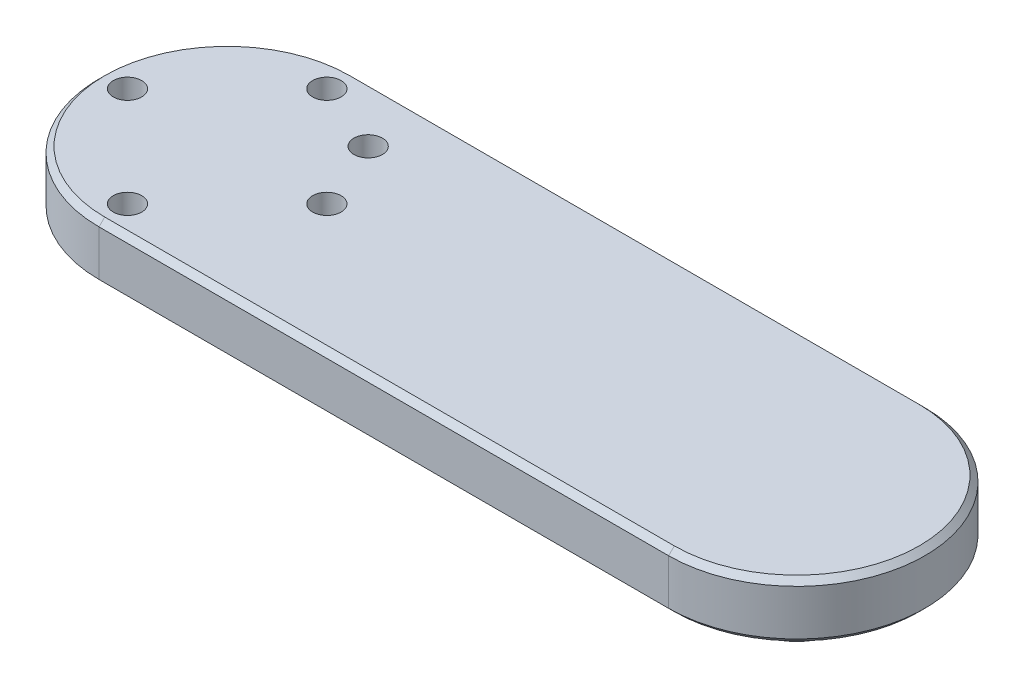
ISO-10303-21;
HEADER;
FILE_DESCRIPTION(('STEP AP214'),'2;1');
FILE_NAME('part.step','',(''),(''),'','','');
FILE_SCHEMA(('AUTOMOTIVE_DESIGN { 1 0 10303 214 1 1 1 1 }'));
ENDSEC;
DATA;
#1=APPLICATION_CONTEXT('core data for automotive mechanical design processes');
#2=APPLICATION_PROTOCOL_DEFINITION('international standard','automotive_design',2000,#1);
#3=PRODUCT_CONTEXT('',#1,'mechanical');
#4=PRODUCT('Part','Part','',(#3));
#5=PRODUCT_RELATED_PRODUCT_CATEGORY('part','',(#4));
#6=PRODUCT_DEFINITION_FORMATION('','',#4);
#7=PRODUCT_DEFINITION_CONTEXT('part definition',#1,'design');
#8=PRODUCT_DEFINITION('design','',#6,#7);
#9=PRODUCT_DEFINITION_SHAPE('','',#8);
#10=(LENGTH_UNIT() NAMED_UNIT(*) SI_UNIT(.MILLI.,.METRE.));
#11=(NAMED_UNIT(*) PLANE_ANGLE_UNIT() SI_UNIT($,.RADIAN.));
#12=(NAMED_UNIT(*) SI_UNIT($,.STERADIAN.) SOLID_ANGLE_UNIT());
#13=UNCERTAINTY_MEASURE_WITH_UNIT(LENGTH_MEASURE(1.E-05),#10,'distance_accuracy_value','');
#14=(GEOMETRIC_REPRESENTATION_CONTEXT(3) GLOBAL_UNCERTAINTY_ASSIGNED_CONTEXT((#13)) GLOBAL_UNIT_ASSIGNED_CONTEXT((#10,
#11,#12)) REPRESENTATION_CONTEXT('',''));
#15=CARTESIAN_POINT('',(0.,0.,0.));
#16=DIRECTION('',(0.,0.,1.));
#17=DIRECTION('',(1.,0.,0.));
#18=AXIS2_PLACEMENT_3D('',#15,#16,#17);
#19=CARTESIAN_POINT('',(-100.,20.,0.));
#20=DIRECTION('',(0.,-1.,0.));
#21=DIRECTION('',(0.,0.,-1.));
#22=AXIS2_PLACEMENT_3D('',#19,#20,#21);
#23=CYLINDRICAL_SURFACE('',#22,45.);
#24=DIRECTION('',(0.,-1.,0.));
#25=VECTOR('',#24,1.);
#26=CARTESIAN_POINT('',(-100.,20.,45.));
#27=LINE('',#26,#25);
#28=CARTESIAN_POINT('',(-100.,18.,45.));
#29=VERTEX_POINT('',#28);
#30=CARTESIAN_POINT('',(-100.,2.,45.));
#31=VERTEX_POINT('',#30);
#32=EDGE_CURVE('E177',#29,#31,#27,.T.);
#33=ORIENTED_EDGE('',*,*,#32,.F.);
#34=CARTESIAN_POINT('',(-100.,18.,0.));
#35=DIRECTION('',(0.,1.,0.));
#36=DIRECTION('',(0.,0.,1.));
#37=AXIS2_PLACEMENT_3D('',#34,#35,#36);
#38=CIRCLE('',#37,45.);
#39=CARTESIAN_POINT('',(-100.,18.,-45.));
#40=VERTEX_POINT('',#39);
#41=EDGE_CURVE('E128',#29,#40,#38,.F.);
#42=ORIENTED_EDGE('',*,*,#41,.T.);
#43=DIRECTION('',(0.,-1.,0.));
#44=VECTOR('',#43,1.);
#45=CARTESIAN_POINT('',(-100.,20.,-45.));
#46=LINE('',#45,#44);
#47=CARTESIAN_POINT('',(-100.,2.,-45.));
#48=VERTEX_POINT('',#47);
#49=EDGE_CURVE('E186',#40,#48,#46,.T.);
#50=ORIENTED_EDGE('',*,*,#49,.T.);
#51=CARTESIAN_POINT('',(-100.,2.,0.));
#52=DIRECTION('',(0.,1.,0.));
#53=DIRECTION('',(0.,0.,1.));
#54=AXIS2_PLACEMENT_3D('',#51,#52,#53);
#55=CIRCLE('',#54,45.);
#56=EDGE_CURVE('E165',#48,#31,#55,.T.);
#57=ORIENTED_EDGE('',*,*,#56,.T.);
#58=EDGE_LOOP('',(#33,#42,#50,#57));
#59=FACE_BOUND('',#58,.T.);
#60=ADVANCED_FACE('F35',(#59),#23,.T.);
#61=CARTESIAN_POINT('',(100.,20.,45.));
#62=DIRECTION('',(0.,0.,-1.));
#63=DIRECTION('',(-1.,0.,0.));
#64=AXIS2_PLACEMENT_3D('',#61,#62,#63);
#65=PLANE('',#64);
#66=DIRECTION('',(0.,-1.,0.));
#67=VECTOR('',#66,1.);
#68=CARTESIAN_POINT('',(100.,20.,45.));
#69=LINE('',#68,#67);
#70=CARTESIAN_POINT('',(100.,18.,45.));
#71=VERTEX_POINT('',#70);
#72=CARTESIAN_POINT('',(100.,2.,45.));
#73=VERTEX_POINT('',#72);
#74=EDGE_CURVE('E180',#71,#73,#69,.T.);
#75=ORIENTED_EDGE('',*,*,#74,.F.);
#76=DIRECTION('',(-1.,0.,0.));
#77=VECTOR('',#76,1.);
#78=CARTESIAN_POINT('',(-100.,18.,45.));
#79=LINE('',#78,#77);
#80=EDGE_CURVE('E156',#71,#29,#79,.T.);
#81=ORIENTED_EDGE('',*,*,#80,.T.);
#82=ORIENTED_EDGE('',*,*,#32,.T.);
#83=DIRECTION('',(1.,0.,0.));
#84=VECTOR('',#83,1.);
#85=CARTESIAN_POINT('',(100.,2.,45.));
#86=LINE('',#85,#84);
#87=EDGE_CURVE('E158',#31,#73,#86,.T.);
#88=ORIENTED_EDGE('',*,*,#87,.T.);
#89=EDGE_LOOP('',(#75,#81,#82,#88));
#90=FACE_BOUND('',#89,.T.);
#91=ADVANCED_FACE('F262',(#90),#65,.F.);
#92=CARTESIAN_POINT('',(100.,20.,0.));
#93=DIRECTION('',(0.,-1.,0.));
#94=DIRECTION('',(0.,0.,-1.));
#95=AXIS2_PLACEMENT_3D('',#92,#93,#94);
#96=CYLINDRICAL_SURFACE('',#95,45.);
#97=DIRECTION('',(0.,-1.,0.));
#98=VECTOR('',#97,1.);
#99=CARTESIAN_POINT('',(100.,20.,-45.));
#100=LINE('',#99,#98);
#101=CARTESIAN_POINT('',(100.,18.,-45.));
#102=VERTEX_POINT('',#101);
#103=CARTESIAN_POINT('',(100.,2.,-45.));
#104=VERTEX_POINT('',#103);
#105=EDGE_CURVE('E183',#102,#104,#100,.T.);
#106=ORIENTED_EDGE('',*,*,#105,.F.);
#107=CARTESIAN_POINT('',(100.,18.,0.));
#108=DIRECTION('',(0.,1.,0.));
#109=DIRECTION('',(0.,0.,1.));
#110=AXIS2_PLACEMENT_3D('',#107,#108,#109);
#111=CIRCLE('',#110,45.);
#112=EDGE_CURVE('E160',#102,#71,#111,.F.);
#113=ORIENTED_EDGE('',*,*,#112,.T.);
#114=ORIENTED_EDGE('',*,*,#74,.T.);
#115=CARTESIAN_POINT('',(100.,2.,0.));
#116=DIRECTION('',(0.,1.,0.));
#117=DIRECTION('',(0.,0.,1.));
#118=AXIS2_PLACEMENT_3D('',#115,#116,#117);
#119=CIRCLE('',#118,45.);
#120=EDGE_CURVE('E162',#73,#104,#119,.T.);
#121=ORIENTED_EDGE('',*,*,#120,.T.);
#122=EDGE_LOOP('',(#106,#113,#114,#121));
#123=FACE_BOUND('',#122,.T.);
#124=ADVANCED_FACE('F258',(#123),#96,.T.);
#125=CARTESIAN_POINT('',(-100.,20.,-45.));
#126=DIRECTION('',(0.,0.,1.));
#127=DIRECTION('',(1.,0.,0.));
#128=AXIS2_PLACEMENT_3D('',#125,#126,#127);
#129=PLANE('',#128);
#130=ORIENTED_EDGE('',*,*,#49,.F.);
#131=DIRECTION('',(1.,0.,0.));
#132=VECTOR('',#131,1.);
#133=CARTESIAN_POINT('',(100.,18.,-45.));
#134=LINE('',#133,#132);
#135=EDGE_CURVE('E167',#40,#102,#134,.T.);
#136=ORIENTED_EDGE('',*,*,#135,.T.);
#137=ORIENTED_EDGE('',*,*,#105,.T.);
#138=DIRECTION('',(-1.,0.,0.));
#139=VECTOR('',#138,1.);
#140=CARTESIAN_POINT('',(-100.,2.,-45.));
#141=LINE('',#140,#139);
#142=EDGE_CURVE('E170',#104,#48,#141,.T.);
#143=ORIENTED_EDGE('',*,*,#142,.T.);
#144=EDGE_LOOP('',(#130,#136,#137,#143));
#145=FACE_BOUND('',#144,.T.);
#146=ADVANCED_FACE('F253',(#145),#129,.F.);
#147=CARTESIAN_POINT('',(-100.,20.,0.));
#148=DIRECTION('',(0.,1.,0.));
#149=DIRECTION('',(0.,0.,1.));
#150=AXIS2_PLACEMENT_3D('',#147,#148,#149);
#151=PLANE('',#150);
#152=CARTESIAN_POINT('',(100.,20.,0.));
#153=DIRECTION('',(0.,1.,0.));
#154=DIRECTION('',(0.,0.,1.));
#155=AXIS2_PLACEMENT_3D('',#152,#153,#154);
#156=CIRCLE('',#155,43.);
#157=CARTESIAN_POINT('',(100.,20.,43.));
#158=VERTEX_POINT('',#157);
#159=CARTESIAN_POINT('',(100.,20.,-43.));
#160=VERTEX_POINT('',#159);
#161=EDGE_CURVE('E114',#158,#160,#156,.T.);
#162=ORIENTED_EDGE('',*,*,#161,.T.);
#163=DIRECTION('',(-1.,0.,0.));
#164=VECTOR('',#163,1.);
#165=CARTESIAN_POINT('',(-100.,20.,-43.));
#166=LINE('',#165,#164);
#167=CARTESIAN_POINT('',(-100.,20.,-43.));
#168=VERTEX_POINT('',#167);
#169=EDGE_CURVE('E110',#160,#168,#166,.T.);
#170=ORIENTED_EDGE('',*,*,#169,.T.);
#171=CARTESIAN_POINT('',(-100.,20.,0.));
#172=DIRECTION('',(0.,1.,0.));
#173=DIRECTION('',(0.,0.,1.));
#174=AXIS2_PLACEMENT_3D('',#171,#172,#173);
#175=CIRCLE('',#174,43.);
#176=CARTESIAN_POINT('',(-100.,20.,43.));
#177=VERTEX_POINT('',#176);
#178=EDGE_CURVE('E103',#168,#177,#175,.T.);
#179=ORIENTED_EDGE('',*,*,#178,.T.);
#180=DIRECTION('',(1.,0.,0.));
#181=VECTOR('',#180,1.);
#182=CARTESIAN_POINT('',(100.,20.,43.));
#183=LINE('',#182,#181);
#184=EDGE_CURVE('E107',#177,#158,#183,.T.);
#185=ORIENTED_EDGE('',*,*,#184,.T.);
#186=EDGE_LOOP('',(#162,#170,#179,#185));
#187=FACE_BOUND('',#186,.T.);
#188=CARTESIAN_POINT('',(-135.,20.,0.));
#189=DIRECTION('',(0.,1.,0.));
#190=DIRECTION('',(0.,0.,1.));
#191=AXIS2_PLACEMENT_3D('',#188,#189,#190);
#192=CIRCLE('',#191,4.99999999999999);
#193=CARTESIAN_POINT('',(-135.,20.,4.99999999999998));
#194=VERTEX_POINT('',#193);
#195=EDGE_CURVE('E214',#194,#194,#192,.T.);
#196=ORIENTED_EDGE('',*,*,#195,.F.);
#197=EDGE_LOOP('',(#196));
#198=FACE_BOUND('',#197,.T.);
#199=CARTESIAN_POINT('',(-75.2512626584709,20.,-24.7487373415292));
#200=DIRECTION('',(0.,1.,0.));
#201=DIRECTION('',(0.,0.,1.));
#202=AXIS2_PLACEMENT_3D('',#199,#200,#201);
#203=CIRCLE('',#202,5.);
#204=CARTESIAN_POINT('',(-75.2512626584709,20.,-19.7487373415292));
#205=VERTEX_POINT('',#204);
#206=EDGE_CURVE('E208',#205,#205,#203,.T.);
#207=ORIENTED_EDGE('',*,*,#206,.F.);
#208=EDGE_LOOP('',(#207));
#209=FACE_BOUND('',#208,.T.);
#210=CARTESIAN_POINT('',(-99.9999999999999,20.,-35.));
#211=DIRECTION('',(0.,1.,0.));
#212=DIRECTION('',(0.,0.,1.));
#213=AXIS2_PLACEMENT_3D('',#210,#211,#212);
#214=CIRCLE('',#213,4.99999999999999);
#215=CARTESIAN_POINT('',(-99.9999999999999,20.,-30.));
#216=VERTEX_POINT('',#215);
#217=EDGE_CURVE('E202',#216,#216,#214,.T.);
#218=ORIENTED_EDGE('',*,*,#217,.F.);
#219=EDGE_LOOP('',(#218));
#220=FACE_BOUND('',#219,.T.);
#221=CARTESIAN_POINT('',(-65.,20.,2.50494156623275E-13));
#222=DIRECTION('',(0.,1.,0.));
#223=DIRECTION('',(0.,0.,1.));
#224=AXIS2_PLACEMENT_3D('',#221,#222,#223);
#225=CIRCLE('',#224,4.99999999999998);
#226=CARTESIAN_POINT('',(-65.,20.,5.00000000000023));
#227=VERTEX_POINT('',#226);
#228=EDGE_CURVE('E196',#227,#227,#225,.T.);
#229=ORIENTED_EDGE('',*,*,#228,.F.);
#230=EDGE_LOOP('',(#229));
#231=FACE_BOUND('',#230,.T.);
#232=CARTESIAN_POINT('',(-100.,20.,35.));
#233=DIRECTION('',(0.,1.,0.));
#234=DIRECTION('',(0.,0.,1.));
#235=AXIS2_PLACEMENT_3D('',#232,#233,#234);
#236=CIRCLE('',#235,5.00000000000001);
#237=CARTESIAN_POINT('',(-100.,20.,40.));
#238=VERTEX_POINT('',#237);
#239=EDGE_CURVE('E190',#238,#238,#236,.T.);
#240=ORIENTED_EDGE('',*,*,#239,.F.);
#241=EDGE_LOOP('',(#240));
#242=FACE_BOUND('',#241,.T.);
#243=ADVANCED_FACE('F105',(#187,#198,#209,#220,#231,#242),#151,.T.);
#244=CARTESIAN_POINT('',(-100.,0.,0.));
#245=DIRECTION('',(0.,1.,0.));
#246=DIRECTION('',(0.,0.,1.));
#247=AXIS2_PLACEMENT_3D('',#244,#245,#246);
#248=PLANE('',#247);
#249=CARTESIAN_POINT('',(-100.,0.,0.));
#250=DIRECTION('',(0.,1.,0.));
#251=DIRECTION('',(0.,0.,1.));
#252=AXIS2_PLACEMENT_3D('',#249,#250,#251);
#253=CIRCLE('',#252,43.);
#254=CARTESIAN_POINT('',(-100.,0.,43.));
#255=VERTEX_POINT('',#254);
#256=CARTESIAN_POINT('',(-100.,0.,-43.));
#257=VERTEX_POINT('',#256);
#258=EDGE_CURVE('E45',#255,#257,#253,.F.);
#259=ORIENTED_EDGE('',*,*,#258,.T.);
#260=DIRECTION('',(1.,0.,0.));
#261=VECTOR('',#260,1.);
#262=CARTESIAN_POINT('',(-100.,0.,-43.));
#263=LINE('',#262,#261);
#264=CARTESIAN_POINT('',(100.,0.,-43.));
#265=VERTEX_POINT('',#264);
#266=EDGE_CURVE('E11',#257,#265,#263,.T.);
#267=ORIENTED_EDGE('',*,*,#266,.T.);
#268=CARTESIAN_POINT('',(100.,0.,0.));
#269=DIRECTION('',(0.,1.,0.));
#270=DIRECTION('',(0.,0.,1.));
#271=AXIS2_PLACEMENT_3D('',#268,#269,#270);
#272=CIRCLE('',#271,43.);
#273=CARTESIAN_POINT('',(100.,0.,43.));
#274=VERTEX_POINT('',#273);
#275=EDGE_CURVE('E152',#265,#274,#272,.F.);
#276=ORIENTED_EDGE('',*,*,#275,.T.);
#277=DIRECTION('',(-1.,0.,0.));
#278=VECTOR('',#277,1.);
#279=CARTESIAN_POINT('',(-100.,0.,43.));
#280=LINE('',#279,#278);
#281=EDGE_CURVE('E154',#274,#255,#280,.T.);
#282=ORIENTED_EDGE('',*,*,#281,.T.);
#283=EDGE_LOOP('',(#259,#267,#276,#282));
#284=FACE_BOUND('',#283,.T.);
#285=CARTESIAN_POINT('',(100.,0.,0.));
#286=DIRECTION('',(0.,1.,0.));
#287=DIRECTION('',(0.,0.,1.));
#288=AXIS2_PLACEMENT_3D('',#285,#286,#287);
#289=CIRCLE('',#288,15.);
#290=CARTESIAN_POINT('',(100.,0.,15.));
#291=VERTEX_POINT('',#290);
#292=EDGE_CURVE('E125',#291,#291,#289,.F.);
#293=ORIENTED_EDGE('',*,*,#292,.F.);
#294=EDGE_LOOP('',(#293));
#295=FACE_BOUND('',#294,.T.);
#296=CARTESIAN_POINT('',(-135.,0.,0.));
#297=DIRECTION('',(0.,1.,0.));
#298=DIRECTION('',(0.,0.,1.));
#299=AXIS2_PLACEMENT_3D('',#296,#297,#298);
#300=CIRCLE('',#299,4.99999999999999);
#301=CARTESIAN_POINT('',(-135.,0.,4.99999999999998));
#302=VERTEX_POINT('',#301);
#303=EDGE_CURVE('E189',#302,#302,#300,.T.);
#304=ORIENTED_EDGE('',*,*,#303,.T.);
#305=EDGE_LOOP('',(#304));
#306=FACE_BOUND('',#305,.T.);
#307=CARTESIAN_POINT('',(-75.2512626584709,0.,-24.7487373415292));
#308=DIRECTION('',(0.,1.,0.));
#309=DIRECTION('',(0.,0.,1.));
#310=AXIS2_PLACEMENT_3D('',#307,#308,#309);
#311=CIRCLE('',#310,5.);
#312=CARTESIAN_POINT('',(-75.2512626584709,0.,-19.7487373415292));
#313=VERTEX_POINT('',#312);
#314=EDGE_CURVE('E211',#313,#313,#311,.T.);
#315=ORIENTED_EDGE('',*,*,#314,.T.);
#316=EDGE_LOOP('',(#315));
#317=FACE_BOUND('',#316,.T.);
#318=CARTESIAN_POINT('',(-99.9999999999999,0.,-35.));
#319=DIRECTION('',(0.,1.,0.));
#320=DIRECTION('',(0.,0.,1.));
#321=AXIS2_PLACEMENT_3D('',#318,#319,#320);
#322=CIRCLE('',#321,4.99999999999999);
#323=CARTESIAN_POINT('',(-99.9999999999999,0.,-30.));
#324=VERTEX_POINT('',#323);
#325=EDGE_CURVE('E205',#324,#324,#322,.T.);
#326=ORIENTED_EDGE('',*,*,#325,.T.);
#327=EDGE_LOOP('',(#326));
#328=FACE_BOUND('',#327,.T.);
#329=CARTESIAN_POINT('',(-65.,0.,2.50494156623275E-13));
#330=DIRECTION('',(0.,1.,0.));
#331=DIRECTION('',(0.,0.,1.));
#332=AXIS2_PLACEMENT_3D('',#329,#330,#331);
#333=CIRCLE('',#332,4.99999999999998);
#334=CARTESIAN_POINT('',(-65.,0.,5.00000000000023));
#335=VERTEX_POINT('',#334);
#336=EDGE_CURVE('E199',#335,#335,#333,.T.);
#337=ORIENTED_EDGE('',*,*,#336,.T.);
#338=EDGE_LOOP('',(#337));
#339=FACE_BOUND('',#338,.T.);
#340=CARTESIAN_POINT('',(-100.,0.,35.));
#341=DIRECTION('',(0.,1.,0.));
#342=DIRECTION('',(0.,0.,1.));
#343=AXIS2_PLACEMENT_3D('',#340,#341,#342);
#344=CIRCLE('',#343,5.00000000000001);
#345=CARTESIAN_POINT('',(-100.,0.,40.));
#346=VERTEX_POINT('',#345);
#347=EDGE_CURVE('E193',#346,#346,#344,.T.);
#348=ORIENTED_EDGE('',*,*,#347,.T.);
#349=EDGE_LOOP('',(#348));
#350=FACE_BOUND('',#349,.T.);
#351=ADVANCED_FACE('F231',(#284,#295,#306,#317,#328,#339,#350),#248,.F.);
#352=CARTESIAN_POINT('',(-100.,0.,35.));
#353=DIRECTION('',(0.,1.,0.));
#354=DIRECTION('',(0.,0.,1.));
#355=AXIS2_PLACEMENT_3D('',#352,#353,#354);
#356=CYLINDRICAL_SURFACE('',#355,5.00000000000001);
#357=ORIENTED_EDGE('',*,*,#347,.F.);
#358=EDGE_LOOP('',(#357));
#359=FACE_BOUND('',#358,.T.);
#360=ORIENTED_EDGE('',*,*,#239,.T.);
#361=EDGE_LOOP('',(#360));
#362=FACE_BOUND('',#361,.T.);
#363=ADVANCED_FACE('F234',(#359,#362),#356,.F.);
#364=CARTESIAN_POINT('',(-65.,0.,2.50494156623275E-13));
#365=DIRECTION('',(0.,1.,0.));
#366=DIRECTION('',(0.,0.,1.));
#367=AXIS2_PLACEMENT_3D('',#364,#365,#366);
#368=CYLINDRICAL_SURFACE('',#367,4.99999999999998);
#369=ORIENTED_EDGE('',*,*,#336,.F.);
#370=EDGE_LOOP('',(#369));
#371=FACE_BOUND('',#370,.T.);
#372=ORIENTED_EDGE('',*,*,#228,.T.);
#373=EDGE_LOOP('',(#372));
#374=FACE_BOUND('',#373,.T.);
#375=ADVANCED_FACE('F248',(#371,#374),#368,.F.);
#376=CARTESIAN_POINT('',(-99.9999999999999,0.,-35.));
#377=DIRECTION('',(0.,1.,0.));
#378=DIRECTION('',(0.,0.,1.));
#379=AXIS2_PLACEMENT_3D('',#376,#377,#378);
#380=CYLINDRICAL_SURFACE('',#379,4.99999999999999);
#381=ORIENTED_EDGE('',*,*,#325,.F.);
#382=EDGE_LOOP('',(#381));
#383=FACE_BOUND('',#382,.T.);
#384=ORIENTED_EDGE('',*,*,#217,.T.);
#385=EDGE_LOOP('',(#384));
#386=FACE_BOUND('',#385,.T.);
#387=ADVANCED_FACE('F417',(#383,#386),#380,.F.);
#388=CARTESIAN_POINT('',(-75.2512626584709,0.,-24.7487373415292));
#389=DIRECTION('',(0.,1.,0.));
#390=DIRECTION('',(0.,0.,1.));
#391=AXIS2_PLACEMENT_3D('',#388,#389,#390);
#392=CYLINDRICAL_SURFACE('',#391,5.);
#393=ORIENTED_EDGE('',*,*,#314,.F.);
#394=EDGE_LOOP('',(#393));
#395=FACE_BOUND('',#394,.T.);
#396=ORIENTED_EDGE('',*,*,#206,.T.);
#397=EDGE_LOOP('',(#396));
#398=FACE_BOUND('',#397,.T.);
#399=ADVANCED_FACE('F409',(#395,#398),#392,.F.);
#400=CARTESIAN_POINT('',(-135.,0.,0.));
#401=DIRECTION('',(0.,1.,0.));
#402=DIRECTION('',(0.,0.,1.));
#403=AXIS2_PLACEMENT_3D('',#400,#401,#402);
#404=CYLINDRICAL_SURFACE('',#403,4.99999999999999);
#405=ORIENTED_EDGE('',*,*,#303,.F.);
#406=EDGE_LOOP('',(#405));
#407=FACE_BOUND('',#406,.T.);
#408=ORIENTED_EDGE('',*,*,#195,.T.);
#409=EDGE_LOOP('',(#408));
#410=FACE_BOUND('',#409,.T.);
#411=ADVANCED_FACE('F227',(#407,#410),#404,.F.);
#412=CARTESIAN_POINT('',(100.,-20.,0.));
#413=DIRECTION('',(0.,1.,0.));
#414=DIRECTION('',(0.,0.,1.));
#415=AXIS2_PLACEMENT_3D('',#412,#413,#414);
#416=CYLINDRICAL_SURFACE('',#415,15.);
#417=CARTESIAN_POINT('',(100.,-20.,0.));
#418=DIRECTION('',(0.,-1.,0.));
#419=DIRECTION('',(0.,0.,-1.));
#420=AXIS2_PLACEMENT_3D('',#417,#418,#419);
#421=CIRCLE('',#420,15.);
#422=CARTESIAN_POINT('',(100.,-20.,-15.));
#423=VERTEX_POINT('',#422);
#424=EDGE_CURVE('E131',#423,#423,#421,.T.);
#425=ORIENTED_EDGE('',*,*,#424,.F.);
#426=EDGE_LOOP('',(#425));
#427=FACE_BOUND('',#426,.T.);
#428=ORIENTED_EDGE('',*,*,#292,.T.);
#429=EDGE_LOOP('',(#428));
#430=FACE_BOUND('',#429,.T.);
#431=ADVANCED_FACE('F224',(#427,#430),#416,.T.);
#432=CARTESIAN_POINT('',(100.,-20.,0.));
#433=DIRECTION('',(0.,-1.,0.));
#434=DIRECTION('',(0.,0.,-1.));
#435=AXIS2_PLACEMENT_3D('',#432,#433,#434);
#436=PLANE('',#435);
#437=ORIENTED_EDGE('',*,*,#424,.T.);
#438=EDGE_LOOP('',(#437));
#439=FACE_BOUND('',#438,.T.);
#440=ADVANCED_FACE('F222',(#439),#436,.T.);
#441=CARTESIAN_POINT('',(-100.,20.,43.));
#442=DIRECTION('',(0.,0.707106781186547,0.707106781186547));
#443=DIRECTION('',(-1.,0.,0.));
#444=AXIS2_PLACEMENT_3D('',#441,#442,#443);
#445=PLANE('',#444);
#446=DIRECTION('',(0.,0.707106781186547,-0.707106781186547));
#447=VECTOR('',#446,1.);
#448=CARTESIAN_POINT('',(-100.,18.,45.));
#449=LINE('',#448,#447);
#450=EDGE_CURVE('E120',#29,#177,#449,.T.);
#451=ORIENTED_EDGE('',*,*,#450,.F.);
#452=ORIENTED_EDGE('',*,*,#80,.F.);
#453=DIRECTION('',(0.,-0.707106781186547,0.707106781186547));
#454=VECTOR('',#453,1.);
#455=CARTESIAN_POINT('',(100.,20.,43.));
#456=LINE('',#455,#454);
#457=EDGE_CURVE('E123',#158,#71,#456,.T.);
#458=ORIENTED_EDGE('',*,*,#457,.F.);
#459=ORIENTED_EDGE('',*,*,#184,.F.);
#460=EDGE_LOOP('',(#451,#452,#458,#459));
#461=FACE_BOUND('',#460,.T.);
#462=ADVANCED_FACE('F118',(#461),#445,.T.);
#463=CARTESIAN_POINT('',(100.,20.,0.));
#464=DIRECTION('',(0.,-1.,0.));
#465=DIRECTION('',(0.,0.,-1.));
#466=AXIS2_PLACEMENT_3D('',#463,#464,#465);
#467=CONICAL_SURFACE('',#466,43.,0.785398163397448);
#468=ORIENTED_EDGE('',*,*,#457,.T.);
#469=ORIENTED_EDGE('',*,*,#112,.F.);
#470=DIRECTION('',(0.,-0.707106781186547,-0.707106781186547));
#471=VECTOR('',#470,1.);
#472=CARTESIAN_POINT('',(100.,20.,-43.));
#473=LINE('',#472,#471);
#474=EDGE_CURVE('E129',#160,#102,#473,.T.);
#475=ORIENTED_EDGE('',*,*,#474,.F.);
#476=ORIENTED_EDGE('',*,*,#161,.F.);
#477=EDGE_LOOP('',(#468,#469,#475,#476));
#478=FACE_BOUND('',#477,.T.);
#479=ADVANCED_FACE('F285',(#478),#467,.T.);
#480=CARTESIAN_POINT('',(-100.,20.,0.));
#481=DIRECTION('',(0.,-1.,0.));
#482=DIRECTION('',(0.,0.,-1.));
#483=AXIS2_PLACEMENT_3D('',#480,#481,#482);
#484=CONICAL_SURFACE('',#483,43.,0.785398163397448);
#485=ORIENTED_EDGE('',*,*,#450,.T.);
#486=ORIENTED_EDGE('',*,*,#178,.F.);
#487=DIRECTION('',(0.,0.707106781186547,0.707106781186547));
#488=VECTOR('',#487,1.);
#489=CARTESIAN_POINT('',(-100.,18.,-45.));
#490=LINE('',#489,#488);
#491=EDGE_CURVE('E133',#40,#168,#490,.T.);
#492=ORIENTED_EDGE('',*,*,#491,.F.);
#493=ORIENTED_EDGE('',*,*,#41,.F.);
#494=EDGE_LOOP('',(#485,#486,#492,#493));
#495=FACE_BOUND('',#494,.T.);
#496=ADVANCED_FACE('F127',(#495),#484,.T.);
#497=CARTESIAN_POINT('',(-100.,20.,-43.));
#498=DIRECTION('',(0.,0.707106781186547,-0.707106781186547));
#499=DIRECTION('',(1.,0.,0.));
#500=AXIS2_PLACEMENT_3D('',#497,#498,#499);
#501=PLANE('',#500);
#502=ORIENTED_EDGE('',*,*,#474,.T.);
#503=ORIENTED_EDGE('',*,*,#135,.F.);
#504=ORIENTED_EDGE('',*,*,#491,.T.);
#505=ORIENTED_EDGE('',*,*,#169,.F.);
#506=EDGE_LOOP('',(#502,#503,#504,#505));
#507=FACE_BOUND('',#506,.T.);
#508=ADVANCED_FACE('F274',(#507),#501,.T.);
#509=CARTESIAN_POINT('',(100.,2.,45.));
#510=DIRECTION('',(0.,0.707106781186547,-0.707106781186547));
#511=DIRECTION('',(1.,0.,0.));
#512=AXIS2_PLACEMENT_3D('',#509,#510,#511);
#513=PLANE('',#512);
#514=DIRECTION('',(0.,0.707106781186547,0.707106781186547));
#515=VECTOR('',#514,1.);
#516=CARTESIAN_POINT('',(-100.,0.,43.));
#517=LINE('',#516,#515);
#518=EDGE_CURVE('E139',#255,#31,#517,.T.);
#519=ORIENTED_EDGE('',*,*,#518,.F.);
#520=ORIENTED_EDGE('',*,*,#281,.F.);
#521=DIRECTION('',(0.,-0.707106781186547,-0.707106781186547));
#522=VECTOR('',#521,1.);
#523=CARTESIAN_POINT('',(100.,2.,45.));
#524=LINE('',#523,#522);
#525=EDGE_CURVE('E40',#73,#274,#524,.T.);
#526=ORIENTED_EDGE('',*,*,#525,.F.);
#527=ORIENTED_EDGE('',*,*,#87,.F.);
#528=EDGE_LOOP('',(#519,#520,#526,#527));
#529=FACE_BOUND('',#528,.T.);
#530=ADVANCED_FACE('F38',(#529),#513,.F.);
#531=CARTESIAN_POINT('',(100.,2.,0.));
#532=DIRECTION('',(0.,1.,0.));
#533=DIRECTION('',(0.,0.,1.));
#534=AXIS2_PLACEMENT_3D('',#531,#532,#533);
#535=CONICAL_SURFACE('',#534,45.,0.785398163397448);
#536=ORIENTED_EDGE('',*,*,#525,.T.);
#537=ORIENTED_EDGE('',*,*,#275,.F.);
#538=DIRECTION('',(0.,-0.707106781186547,0.707106781186547));
#539=VECTOR('',#538,1.);
#540=CARTESIAN_POINT('',(100.,2.,-45.));
#541=LINE('',#540,#539);
#542=EDGE_CURVE('E58',#104,#265,#541,.T.);
#543=ORIENTED_EDGE('',*,*,#542,.F.);
#544=ORIENTED_EDGE('',*,*,#120,.F.);
#545=EDGE_LOOP('',(#536,#537,#543,#544));
#546=FACE_BOUND('',#545,.T.);
#547=ADVANCED_FACE('F308',(#546),#535,.T.);
#548=CARTESIAN_POINT('',(-100.,2.,0.));
#549=DIRECTION('',(0.,1.,0.));
#550=DIRECTION('',(0.,0.,1.));
#551=AXIS2_PLACEMENT_3D('',#548,#549,#550);
#552=CONICAL_SURFACE('',#551,45.,0.785398163397448);
#553=ORIENTED_EDGE('',*,*,#518,.T.);
#554=ORIENTED_EDGE('',*,*,#56,.F.);
#555=DIRECTION('',(0.,0.707106781186547,-0.707106781186547));
#556=VECTOR('',#555,1.);
#557=CARTESIAN_POINT('',(-100.,0.,-43.));
#558=LINE('',#557,#556);
#559=EDGE_CURVE('E137',#257,#48,#558,.T.);
#560=ORIENTED_EDGE('',*,*,#559,.F.);
#561=ORIENTED_EDGE('',*,*,#258,.F.);
#562=EDGE_LOOP('',(#553,#554,#560,#561));
#563=FACE_BOUND('',#562,.T.);
#564=ADVANCED_FACE('F303',(#563),#552,.T.);
#565=CARTESIAN_POINT('',(-100.,2.,-45.));
#566=DIRECTION('',(0.,0.707106781186547,0.707106781186547));
#567=DIRECTION('',(-1.,0.,0.));
#568=AXIS2_PLACEMENT_3D('',#565,#566,#567);
#569=PLANE('',#568);
#570=ORIENTED_EDGE('',*,*,#542,.T.);
#571=ORIENTED_EDGE('',*,*,#266,.F.);
#572=ORIENTED_EDGE('',*,*,#559,.T.);
#573=ORIENTED_EDGE('',*,*,#142,.F.);
#574=EDGE_LOOP('',(#570,#571,#572,#573));
#575=FACE_BOUND('',#574,.T.);
#576=ADVANCED_FACE('F297',(#575),#569,.F.);
#577=CLOSED_SHELL('',(#60,#91,#124,#146,#243,#351,#363,#375,#387,#399,#411,#431,#440,#462,#479,
#496,#508,#530,#547,#564,#576));
#578=MANIFOLD_SOLID_BREP('B2',#577);
#579=ADVANCED_BREP_SHAPE_REPRESENTATION('',(#18,#578),#14);
#580=SHAPE_DEFINITION_REPRESENTATION(#9,#579);
ENDSEC;
END-ISO-10303-21;
